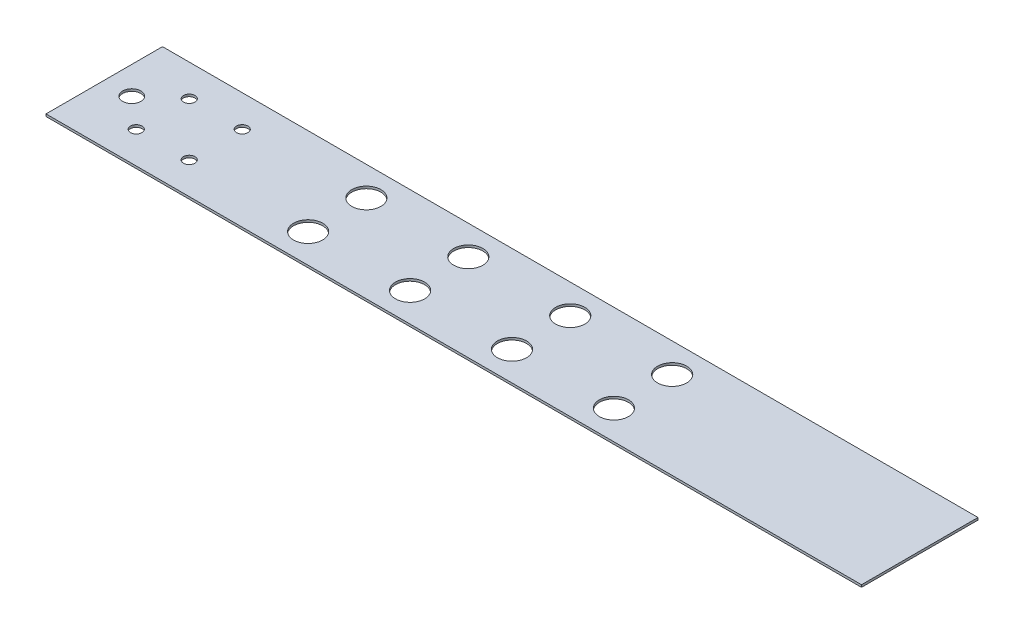
ISO-10303-21;
HEADER;
FILE_DESCRIPTION(('STEP AP214'),'2;1');
FILE_NAME('part.step','',(''),(''),'','','');
FILE_SCHEMA(('AUTOMOTIVE_DESIGN { 1 0 10303 214 1 1 1 1 }'));
ENDSEC;
DATA;
#1=APPLICATION_CONTEXT('core data for automotive mechanical design processes');
#2=APPLICATION_PROTOCOL_DEFINITION('international standard','automotive_design',2000,#1);
#3=PRODUCT_CONTEXT('',#1,'mechanical');
#4=PRODUCT('Part','Part','',(#3));
#5=PRODUCT_RELATED_PRODUCT_CATEGORY('part','',(#4));
#6=PRODUCT_DEFINITION_FORMATION('','',#4);
#7=PRODUCT_DEFINITION_CONTEXT('part definition',#1,'design');
#8=PRODUCT_DEFINITION('design','',#6,#7);
#9=PRODUCT_DEFINITION_SHAPE('','',#8);
#10=(LENGTH_UNIT() NAMED_UNIT(*) SI_UNIT(.MILLI.,.METRE.));
#11=(NAMED_UNIT(*) PLANE_ANGLE_UNIT() SI_UNIT($,.RADIAN.));
#12=(NAMED_UNIT(*) SI_UNIT($,.STERADIAN.) SOLID_ANGLE_UNIT());
#13=UNCERTAINTY_MEASURE_WITH_UNIT(LENGTH_MEASURE(1.E-05),#10,'distance_accuracy_value','');
#14=(GEOMETRIC_REPRESENTATION_CONTEXT(3) GLOBAL_UNCERTAINTY_ASSIGNED_CONTEXT((#13)) GLOBAL_UNIT_ASSIGNED_CONTEXT((#10,
#11,#12)) REPRESENTATION_CONTEXT('',''));
#15=CARTESIAN_POINT('',(0.,0.,0.));
#16=DIRECTION('',(0.,0.,1.));
#17=DIRECTION('',(1.,0.,0.));
#18=AXIS2_PLACEMENT_3D('',#15,#16,#17);
#19=CARTESIAN_POINT('',(-177.8,1.,25.4));
#20=DIRECTION('',(1.,0.,0.));
#21=DIRECTION('',(0.,0.,-1.));
#22=AXIS2_PLACEMENT_3D('',#19,#20,#21);
#23=PLANE('',#22);
#24=DIRECTION('',(0.,0.,1.));
#25=VECTOR('',#24,1.);
#26=CARTESIAN_POINT('',(-177.8,0.,25.4));
#27=LINE('',#26,#25);
#28=CARTESIAN_POINT('',(-177.8,0.,-25.4));
#29=VERTEX_POINT('',#28);
#30=CARTESIAN_POINT('',(-177.8,0.,25.4));
#31=VERTEX_POINT('',#30);
#32=EDGE_CURVE('E99',#29,#31,#27,.T.);
#33=ORIENTED_EDGE('',*,*,#32,.T.);
#34=DIRECTION('',(0.,-1.,0.));
#35=VECTOR('',#34,1.);
#36=CARTESIAN_POINT('',(-177.8,1.,25.4));
#37=LINE('',#36,#35);
#38=CARTESIAN_POINT('',(-177.8,1.,25.4));
#39=VERTEX_POINT('',#38);
#40=EDGE_CURVE('E11',#39,#31,#37,.T.);
#41=ORIENTED_EDGE('',*,*,#40,.F.);
#42=DIRECTION('',(0.,0.,1.));
#43=VECTOR('',#42,1.);
#44=CARTESIAN_POINT('',(-177.8,1.,25.4));
#45=LINE('',#44,#43);
#46=CARTESIAN_POINT('',(-177.8,1.,-25.4));
#47=VERTEX_POINT('',#46);
#48=EDGE_CURVE('E86',#47,#39,#45,.T.);
#49=ORIENTED_EDGE('',*,*,#48,.F.);
#50=DIRECTION('',(0.,-1.,0.));
#51=VECTOR('',#50,1.);
#52=CARTESIAN_POINT('',(-177.8,1.,-25.4));
#53=LINE('',#52,#51);
#54=EDGE_CURVE('E95',#47,#29,#53,.T.);
#55=ORIENTED_EDGE('',*,*,#54,.T.);
#56=EDGE_LOOP('',(#33,#41,#49,#55));
#57=FACE_BOUND('',#56,.T.);
#58=ADVANCED_FACE('F33',(#57),#23,.F.);
#59=CARTESIAN_POINT('',(177.8,1.,25.3999999999999));
#60=DIRECTION('',(0.,0.,-1.));
#61=DIRECTION('',(-1.,0.,0.));
#62=AXIS2_PLACEMENT_3D('',#59,#60,#61);
#63=PLANE('',#62);
#64=DIRECTION('',(1.,0.,0.));
#65=VECTOR('',#64,1.);
#66=CARTESIAN_POINT('',(177.8,0.,25.3999999999999));
#67=LINE('',#66,#65);
#68=CARTESIAN_POINT('',(177.8,0.,25.3999999999999));
#69=VERTEX_POINT('',#68);
#70=EDGE_CURVE('E90',#31,#69,#67,.T.);
#71=ORIENTED_EDGE('',*,*,#70,.T.);
#72=DIRECTION('',(0.,-1.,0.));
#73=VECTOR('',#72,1.);
#74=CARTESIAN_POINT('',(177.8,1.,25.3999999999999));
#75=LINE('',#74,#73);
#76=CARTESIAN_POINT('',(177.8,1.,25.3999999999999));
#77=VERTEX_POINT('',#76);
#78=EDGE_CURVE('E42',#77,#69,#75,.T.);
#79=ORIENTED_EDGE('',*,*,#78,.F.);
#80=DIRECTION('',(1.,0.,0.));
#81=VECTOR('',#80,1.);
#82=CARTESIAN_POINT('',(177.8,1.,25.3999999999999));
#83=LINE('',#82,#81);
#84=EDGE_CURVE('E81',#39,#77,#83,.T.);
#85=ORIENTED_EDGE('',*,*,#84,.F.);
#86=ORIENTED_EDGE('',*,*,#40,.T.);
#87=EDGE_LOOP('',(#71,#79,#85,#86));
#88=FACE_BOUND('',#87,.T.);
#89=ADVANCED_FACE('F89',(#88),#63,.F.);
#90=CARTESIAN_POINT('',(177.8,1.,25.3999999999999));
#91=DIRECTION('',(-1.,0.,0.));
#92=DIRECTION('',(0.,0.,1.));
#93=AXIS2_PLACEMENT_3D('',#90,#91,#92);
#94=PLANE('',#93);
#95=DIRECTION('',(0.,0.,-1.));
#96=VECTOR('',#95,1.);
#97=CARTESIAN_POINT('',(177.8,0.,25.3999999999999));
#98=LINE('',#97,#96);
#99=CARTESIAN_POINT('',(177.8,0.,-25.4));
#100=VERTEX_POINT('',#99);
#101=EDGE_CURVE('E68',#69,#100,#98,.T.);
#102=ORIENTED_EDGE('',*,*,#101,.T.);
#103=DIRECTION('',(0.,-1.,0.));
#104=VECTOR('',#103,1.);
#105=CARTESIAN_POINT('',(177.8,1.,-25.4));
#106=LINE('',#105,#104);
#107=CARTESIAN_POINT('',(177.8,1.,-25.4));
#108=VERTEX_POINT('',#107);
#109=EDGE_CURVE('E91',#108,#100,#106,.T.);
#110=ORIENTED_EDGE('',*,*,#109,.F.);
#111=DIRECTION('',(0.,0.,-1.));
#112=VECTOR('',#111,1.);
#113=CARTESIAN_POINT('',(177.8,1.,25.3999999999999));
#114=LINE('',#113,#112);
#115=EDGE_CURVE('E84',#77,#108,#114,.T.);
#116=ORIENTED_EDGE('',*,*,#115,.F.);
#117=ORIENTED_EDGE('',*,*,#78,.T.);
#118=EDGE_LOOP('',(#102,#110,#116,#117));
#119=FACE_BOUND('',#118,.T.);
#120=ADVANCED_FACE('F93',(#119),#94,.F.);
#121=CARTESIAN_POINT('',(177.8,1.,-25.4));
#122=DIRECTION('',(0.,0.,1.));
#123=DIRECTION('',(1.,0.,0.));
#124=AXIS2_PLACEMENT_3D('',#121,#122,#123);
#125=PLANE('',#124);
#126=DIRECTION('',(-1.,0.,0.));
#127=VECTOR('',#126,1.);
#128=CARTESIAN_POINT('',(177.8,0.,-25.4));
#129=LINE('',#128,#127);
#130=EDGE_CURVE('E74',#100,#29,#129,.T.);
#131=ORIENTED_EDGE('',*,*,#130,.T.);
#132=ORIENTED_EDGE('',*,*,#54,.F.);
#133=DIRECTION('',(-1.,0.,0.));
#134=VECTOR('',#133,1.);
#135=CARTESIAN_POINT('',(177.8,1.,-25.4));
#136=LINE('',#135,#134);
#137=EDGE_CURVE('E51',#108,#47,#136,.T.);
#138=ORIENTED_EDGE('',*,*,#137,.F.);
#139=ORIENTED_EDGE('',*,*,#109,.T.);
#140=EDGE_LOOP('',(#131,#132,#138,#139));
#141=FACE_BOUND('',#140,.T.);
#142=ADVANCED_FACE('F169',(#141),#125,.F.);
#143=CARTESIAN_POINT('',(0.,1.,0.));
#144=DIRECTION('',(0.,1.,0.));
#145=DIRECTION('',(0.,0.,1.));
#146=AXIS2_PLACEMENT_3D('',#143,#144,#145);
#147=PLANE('',#146);
#148=CARTESIAN_POINT('',(12.6999999999999,1.,-12.7));
#149=DIRECTION('',(0.,1.,0.));
#150=DIRECTION('',(0.,0.,1.));
#151=AXIS2_PLACEMENT_3D('',#148,#149,#150);
#152=CIRCLE('',#151,6.35);
#153=CARTESIAN_POINT('',(12.6999999999999,1.,-6.35000000000004));
#154=VERTEX_POINT('',#153);
#155=EDGE_CURVE('E339',#154,#154,#152,.T.);
#156=ORIENTED_EDGE('',*,*,#155,.F.);
#157=EDGE_LOOP('',(#156));
#158=FACE_BOUND('',#157,.T.);
#159=CARTESIAN_POINT('',(12.6999999999999,1.,12.7));
#160=DIRECTION('',(0.,1.,0.));
#161=DIRECTION('',(0.,0.,-1.));
#162=AXIS2_PLACEMENT_3D('',#159,#160,#161);
#163=CIRCLE('',#162,6.35);
#164=CARTESIAN_POINT('',(12.6999999999999,1.,6.35000000000004));
#165=VERTEX_POINT('',#164);
#166=EDGE_CURVE('E340',#165,#165,#163,.T.);
#167=ORIENTED_EDGE('',*,*,#166,.F.);
#168=EDGE_LOOP('',(#167));
#169=FACE_BOUND('',#168,.T.);
#170=CARTESIAN_POINT('',(-76.2,1.,12.7));
#171=DIRECTION('',(0.,1.,0.));
#172=DIRECTION('',(0.,0.,-1.));
#173=AXIS2_PLACEMENT_3D('',#170,#171,#172);
#174=CIRCLE('',#173,6.35);
#175=CARTESIAN_POINT('',(-76.2,1.,6.35000000000005));
#176=VERTEX_POINT('',#175);
#177=EDGE_CURVE('E345',#176,#176,#174,.T.);
#178=ORIENTED_EDGE('',*,*,#177,.F.);
#179=EDGE_LOOP('',(#178));
#180=FACE_BOUND('',#179,.T.);
#181=CARTESIAN_POINT('',(-31.7500000000001,1.,-12.7));
#182=DIRECTION('',(0.,1.,0.));
#183=DIRECTION('',(0.,0.,1.));
#184=AXIS2_PLACEMENT_3D('',#181,#182,#183);
#185=CIRCLE('',#184,6.35);
#186=CARTESIAN_POINT('',(-31.7500000000001,1.,-6.35000000000004));
#187=VERTEX_POINT('',#186);
#188=EDGE_CURVE('E353',#187,#187,#185,.T.);
#189=ORIENTED_EDGE('',*,*,#188,.F.);
#190=EDGE_LOOP('',(#189));
#191=FACE_BOUND('',#190,.T.);
#192=CARTESIAN_POINT('',(57.1499999999999,1.,-12.7));
#193=DIRECTION('',(0.,1.,0.));
#194=DIRECTION('',(0.,0.,1.));
#195=AXIS2_PLACEMENT_3D('',#192,#193,#194);
#196=CIRCLE('',#195,6.35);
#197=CARTESIAN_POINT('',(57.1499999999999,1.,-6.35000000000004));
#198=VERTEX_POINT('',#197);
#199=EDGE_CURVE('E355',#198,#198,#196,.T.);
#200=ORIENTED_EDGE('',*,*,#199,.F.);
#201=EDGE_LOOP('',(#200));
#202=FACE_BOUND('',#201,.T.);
#203=CARTESIAN_POINT('',(57.1499999999999,1.,12.7));
#204=DIRECTION('',(0.,1.,0.));
#205=DIRECTION('',(0.,0.,-1.));
#206=AXIS2_PLACEMENT_3D('',#203,#204,#205);
#207=CIRCLE('',#206,6.35);
#208=CARTESIAN_POINT('',(57.1499999999999,1.,6.35000000000004));
#209=VERTEX_POINT('',#208);
#210=EDGE_CURVE('E371',#209,#209,#207,.T.);
#211=ORIENTED_EDGE('',*,*,#210,.F.);
#212=EDGE_LOOP('',(#211));
#213=FACE_BOUND('',#212,.T.);
#214=CARTESIAN_POINT('',(-31.7500000000001,1.,12.7));
#215=DIRECTION('',(0.,1.,0.));
#216=DIRECTION('',(0.,0.,-1.));
#217=AXIS2_PLACEMENT_3D('',#214,#215,#216);
#218=CIRCLE('',#217,6.35);
#219=CARTESIAN_POINT('',(-31.7500000000001,1.,6.35000000000004));
#220=VERTEX_POINT('',#219);
#221=EDGE_CURVE('E348',#220,#220,#218,.T.);
#222=ORIENTED_EDGE('',*,*,#221,.F.);
#223=EDGE_LOOP('',(#222));
#224=FACE_BOUND('',#223,.T.);
#225=CARTESIAN_POINT('',(-76.2,1.,-12.7));
#226=DIRECTION('',(0.,1.,0.));
#227=DIRECTION('',(0.,0.,1.));
#228=AXIS2_PLACEMENT_3D('',#225,#226,#227);
#229=CIRCLE('',#228,6.35);
#230=CARTESIAN_POINT('',(-76.2,1.,-6.35000000000005));
#231=VERTEX_POINT('',#230);
#232=EDGE_CURVE('E126',#231,#231,#229,.T.);
#233=ORIENTED_EDGE('',*,*,#232,.F.);
#234=EDGE_LOOP('',(#233));
#235=FACE_BOUND('',#234,.T.);
#236=CARTESIAN_POINT('',(-152.3,1.,11.55));
#237=DIRECTION('',(0.,1.,0.));
#238=DIRECTION('',(0.,0.,1.));
#239=AXIS2_PLACEMENT_3D('',#236,#237,#238);
#240=CIRCLE('',#239,2.5);
#241=CARTESIAN_POINT('',(-152.3,1.,14.05));
#242=VERTEX_POINT('',#241);
#243=EDGE_CURVE('E145',#242,#242,#240,.T.);
#244=ORIENTED_EDGE('',*,*,#243,.F.);
#245=EDGE_LOOP('',(#244));
#246=FACE_BOUND('',#245,.T.);
#247=CARTESIAN_POINT('',(-129.2,1.,11.55));
#248=DIRECTION('',(0.,1.,0.));
#249=DIRECTION('',(0.,0.,1.));
#250=AXIS2_PLACEMENT_3D('',#247,#248,#249);
#251=CIRCLE('',#250,2.5);
#252=CARTESIAN_POINT('',(-129.2,1.,14.05));
#253=VERTEX_POINT('',#252);
#254=EDGE_CURVE('E149',#253,#253,#251,.T.);
#255=ORIENTED_EDGE('',*,*,#254,.F.);
#256=EDGE_LOOP('',(#255));
#257=FACE_BOUND('',#256,.T.);
#258=CARTESIAN_POINT('',(-129.2,1.,-11.55));
#259=DIRECTION('',(0.,1.,0.));
#260=DIRECTION('',(0.,0.,1.));
#261=AXIS2_PLACEMENT_3D('',#258,#259,#260);
#262=CIRCLE('',#261,2.5);
#263=CARTESIAN_POINT('',(-129.2,1.,-9.05000000000005));
#264=VERTEX_POINT('',#263);
#265=EDGE_CURVE('E154',#264,#264,#262,.T.);
#266=ORIENTED_EDGE('',*,*,#265,.F.);
#267=EDGE_LOOP('',(#266));
#268=FACE_BOUND('',#267,.T.);
#269=CARTESIAN_POINT('',(-152.3,1.,-11.55));
#270=DIRECTION('',(0.,1.,0.));
#271=DIRECTION('',(0.,0.,1.));
#272=AXIS2_PLACEMENT_3D('',#269,#270,#271);
#273=CIRCLE('',#272,2.5);
#274=CARTESIAN_POINT('',(-152.3,1.,-9.05000000000005));
#275=VERTEX_POINT('',#274);
#276=EDGE_CURVE('E112',#275,#275,#273,.T.);
#277=ORIENTED_EDGE('',*,*,#276,.F.);
#278=EDGE_LOOP('',(#277));
#279=FACE_BOUND('',#278,.T.);
#280=CARTESIAN_POINT('',(-165.8,1.,0.));
#281=DIRECTION('',(0.,1.,0.));
#282=DIRECTION('',(0.,0.,1.));
#283=AXIS2_PLACEMENT_3D('',#280,#281,#282);
#284=CIRCLE('',#283,3.96874999999999);
#285=CARTESIAN_POINT('',(-165.8,1.,3.96874999999999));
#286=VERTEX_POINT('',#285);
#287=EDGE_CURVE('E121',#286,#286,#284,.T.);
#288=ORIENTED_EDGE('',*,*,#287,.F.);
#289=EDGE_LOOP('',(#288));
#290=FACE_BOUND('',#289,.T.);
#291=ORIENTED_EDGE('',*,*,#48,.T.);
#292=ORIENTED_EDGE('',*,*,#84,.T.);
#293=ORIENTED_EDGE('',*,*,#115,.T.);
#294=ORIENTED_EDGE('',*,*,#137,.T.);
#295=EDGE_LOOP('',(#291,#292,#293,#294));
#296=FACE_BOUND('',#295,.T.);
#297=ADVANCED_FACE('F82',(#158,#169,#180,#191,#202,#213,#224,#235,#246,#257,#268,#279,#290,
#296),#147,.T.);
#298=CARTESIAN_POINT('',(0.,0.,0.));
#299=DIRECTION('',(0.,1.,0.));
#300=DIRECTION('',(0.,0.,1.));
#301=AXIS2_PLACEMENT_3D('',#298,#299,#300);
#302=PLANE('',#301);
#303=CARTESIAN_POINT('',(12.6999999999999,0.,-12.7));
#304=DIRECTION('',(0.,1.,0.));
#305=DIRECTION('',(0.,0.,1.));
#306=AXIS2_PLACEMENT_3D('',#303,#304,#305);
#307=CIRCLE('',#306,6.35);
#308=CARTESIAN_POINT('',(12.6999999999999,0.,-6.35000000000004));
#309=VERTEX_POINT('',#308);
#310=EDGE_CURVE('E36',#309,#309,#307,.T.);
#311=ORIENTED_EDGE('',*,*,#310,.T.);
#312=EDGE_LOOP('',(#311));
#313=FACE_BOUND('',#312,.T.);
#314=CARTESIAN_POINT('',(12.6999999999999,0.,12.7));
#315=DIRECTION('',(0.,1.,0.));
#316=DIRECTION('',(0.,0.,1.));
#317=AXIS2_PLACEMENT_3D('',#314,#315,#316);
#318=CIRCLE('',#317,6.35);
#319=CARTESIAN_POINT('',(12.6999999999999,0.,19.05));
#320=VERTEX_POINT('',#319);
#321=EDGE_CURVE('E140',#320,#320,#318,.T.);
#322=ORIENTED_EDGE('',*,*,#321,.T.);
#323=EDGE_LOOP('',(#322));
#324=FACE_BOUND('',#323,.T.);
#325=CARTESIAN_POINT('',(-76.2,0.,12.7));
#326=DIRECTION('',(0.,1.,0.));
#327=DIRECTION('',(0.,0.,1.));
#328=AXIS2_PLACEMENT_3D('',#325,#326,#327);
#329=CIRCLE('',#328,6.35);
#330=CARTESIAN_POINT('',(-76.2,0.,19.05));
#331=VERTEX_POINT('',#330);
#332=EDGE_CURVE('E138',#331,#331,#329,.T.);
#333=ORIENTED_EDGE('',*,*,#332,.T.);
#334=EDGE_LOOP('',(#333));
#335=FACE_BOUND('',#334,.T.);
#336=CARTESIAN_POINT('',(-31.7500000000001,0.,-12.7));
#337=DIRECTION('',(0.,1.,0.));
#338=DIRECTION('',(0.,0.,1.));
#339=AXIS2_PLACEMENT_3D('',#336,#337,#338);
#340=CIRCLE('',#339,6.35);
#341=CARTESIAN_POINT('',(-31.7500000000001,0.,-6.35000000000004));
#342=VERTEX_POINT('',#341);
#343=EDGE_CURVE('E135',#342,#342,#340,.T.);
#344=ORIENTED_EDGE('',*,*,#343,.T.);
#345=EDGE_LOOP('',(#344));
#346=FACE_BOUND('',#345,.T.);
#347=CARTESIAN_POINT('',(57.1499999999999,0.,-12.7));
#348=DIRECTION('',(0.,1.,0.));
#349=DIRECTION('',(0.,0.,1.));
#350=AXIS2_PLACEMENT_3D('',#347,#348,#349);
#351=CIRCLE('',#350,6.35);
#352=CARTESIAN_POINT('',(57.1499999999999,0.,-6.35000000000004));
#353=VERTEX_POINT('',#352);
#354=EDGE_CURVE('E132',#353,#353,#351,.T.);
#355=ORIENTED_EDGE('',*,*,#354,.T.);
#356=EDGE_LOOP('',(#355));
#357=FACE_BOUND('',#356,.T.);
#358=CARTESIAN_POINT('',(57.1499999999999,0.,12.7));
#359=DIRECTION('',(0.,1.,0.));
#360=DIRECTION('',(0.,0.,1.));
#361=AXIS2_PLACEMENT_3D('',#358,#359,#360);
#362=CIRCLE('',#361,6.35);
#363=CARTESIAN_POINT('',(57.1499999999999,0.,19.05));
#364=VERTEX_POINT('',#363);
#365=EDGE_CURVE('E129',#364,#364,#362,.T.);
#366=ORIENTED_EDGE('',*,*,#365,.T.);
#367=EDGE_LOOP('',(#366));
#368=FACE_BOUND('',#367,.T.);
#369=CARTESIAN_POINT('',(-31.7500000000001,0.,12.7));
#370=DIRECTION('',(0.,1.,0.));
#371=DIRECTION('',(0.,0.,1.));
#372=AXIS2_PLACEMENT_3D('',#369,#370,#371);
#373=CIRCLE('',#372,6.35);
#374=CARTESIAN_POINT('',(-31.7500000000001,0.,19.05));
#375=VERTEX_POINT('',#374);
#376=EDGE_CURVE('E125',#375,#375,#373,.T.);
#377=ORIENTED_EDGE('',*,*,#376,.T.);
#378=EDGE_LOOP('',(#377));
#379=FACE_BOUND('',#378,.T.);
#380=CARTESIAN_POINT('',(-76.2,0.,-12.7));
#381=DIRECTION('',(0.,1.,0.));
#382=DIRECTION('',(0.,0.,1.));
#383=AXIS2_PLACEMENT_3D('',#380,#381,#382);
#384=CIRCLE('',#383,6.35);
#385=CARTESIAN_POINT('',(-76.2,0.,-6.35000000000005));
#386=VERTEX_POINT('',#385);
#387=EDGE_CURVE('E122',#386,#386,#384,.T.);
#388=ORIENTED_EDGE('',*,*,#387,.T.);
#389=EDGE_LOOP('',(#388));
#390=FACE_BOUND('',#389,.T.);
#391=CARTESIAN_POINT('',(-152.3,0.,11.55));
#392=DIRECTION('',(0.,1.,0.));
#393=DIRECTION('',(0.,0.,1.));
#394=AXIS2_PLACEMENT_3D('',#391,#392,#393);
#395=CIRCLE('',#394,2.5);
#396=CARTESIAN_POINT('',(-152.3,0.,14.05));
#397=VERTEX_POINT('',#396);
#398=EDGE_CURVE('E118',#397,#397,#395,.T.);
#399=ORIENTED_EDGE('',*,*,#398,.T.);
#400=EDGE_LOOP('',(#399));
#401=FACE_BOUND('',#400,.T.);
#402=CARTESIAN_POINT('',(-129.2,0.,11.55));
#403=DIRECTION('',(0.,1.,0.));
#404=DIRECTION('',(0.,0.,1.));
#405=AXIS2_PLACEMENT_3D('',#402,#403,#404);
#406=CIRCLE('',#405,2.5);
#407=CARTESIAN_POINT('',(-129.2,0.,14.05));
#408=VERTEX_POINT('',#407);
#409=EDGE_CURVE('E115',#408,#408,#406,.T.);
#410=ORIENTED_EDGE('',*,*,#409,.T.);
#411=EDGE_LOOP('',(#410));
#412=FACE_BOUND('',#411,.T.);
#413=CARTESIAN_POINT('',(-129.2,0.,-11.55));
#414=DIRECTION('',(0.,1.,0.));
#415=DIRECTION('',(0.,0.,1.));
#416=AXIS2_PLACEMENT_3D('',#413,#414,#415);
#417=CIRCLE('',#416,2.5);
#418=CARTESIAN_POINT('',(-129.2,0.,-9.05000000000005));
#419=VERTEX_POINT('',#418);
#420=EDGE_CURVE('E111',#419,#419,#417,.T.);
#421=ORIENTED_EDGE('',*,*,#420,.T.);
#422=EDGE_LOOP('',(#421));
#423=FACE_BOUND('',#422,.T.);
#424=CARTESIAN_POINT('',(-152.3,0.,-11.55));
#425=DIRECTION('',(0.,1.,0.));
#426=DIRECTION('',(0.,0.,1.));
#427=AXIS2_PLACEMENT_3D('',#424,#425,#426);
#428=CIRCLE('',#427,2.5);
#429=CARTESIAN_POINT('',(-152.3,0.,-9.05000000000005));
#430=VERTEX_POINT('',#429);
#431=EDGE_CURVE('E108',#430,#430,#428,.T.);
#432=ORIENTED_EDGE('',*,*,#431,.T.);
#433=EDGE_LOOP('',(#432));
#434=FACE_BOUND('',#433,.T.);
#435=CARTESIAN_POINT('',(-165.8,0.,0.));
#436=DIRECTION('',(0.,1.,0.));
#437=DIRECTION('',(0.,0.,1.));
#438=AXIS2_PLACEMENT_3D('',#435,#436,#437);
#439=CIRCLE('',#438,3.96874999999999);
#440=CARTESIAN_POINT('',(-165.8,0.,3.96874999999999));
#441=VERTEX_POINT('',#440);
#442=EDGE_CURVE('E102',#441,#441,#439,.T.);
#443=ORIENTED_EDGE('',*,*,#442,.T.);
#444=EDGE_LOOP('',(#443));
#445=FACE_BOUND('',#444,.T.);
#446=ORIENTED_EDGE('',*,*,#32,.F.);
#447=ORIENTED_EDGE('',*,*,#130,.F.);
#448=ORIENTED_EDGE('',*,*,#101,.F.);
#449=ORIENTED_EDGE('',*,*,#70,.F.);
#450=EDGE_LOOP('',(#446,#447,#448,#449));
#451=FACE_BOUND('',#450,.T.);
#452=ADVANCED_FACE('F168',(#313,#324,#335,#346,#357,#368,#379,#390,#401,#412,#423,#434,#445,
#451),#302,.F.);
#453=CARTESIAN_POINT('',(-165.8,0.,0.));
#454=DIRECTION('',(0.,1.,0.));
#455=DIRECTION('',(0.,0.,1.));
#456=AXIS2_PLACEMENT_3D('',#453,#454,#455);
#457=CYLINDRICAL_SURFACE('',#456,3.96874999999999);
#458=ORIENTED_EDGE('',*,*,#442,.F.);
#459=EDGE_LOOP('',(#458));
#460=FACE_BOUND('',#459,.T.);
#461=ORIENTED_EDGE('',*,*,#287,.T.);
#462=EDGE_LOOP('',(#461));
#463=FACE_BOUND('',#462,.T.);
#464=ADVANCED_FACE('F165',(#460,#463),#457,.F.);
#465=CARTESIAN_POINT('',(-152.3,-1.,-11.55));
#466=DIRECTION('',(0.,1.,0.));
#467=DIRECTION('',(0.,0.,1.));
#468=AXIS2_PLACEMENT_3D('',#465,#466,#467);
#469=CYLINDRICAL_SURFACE('',#468,2.5);
#470=ORIENTED_EDGE('',*,*,#276,.T.);
#471=EDGE_LOOP('',(#470));
#472=FACE_BOUND('',#471,.T.);
#473=ORIENTED_EDGE('',*,*,#431,.F.);
#474=EDGE_LOOP('',(#473));
#475=FACE_BOUND('',#474,.T.);
#476=ADVANCED_FACE('F217',(#472,#475),#469,.F.);
#477=CARTESIAN_POINT('',(-129.2,-1.,-11.55));
#478=DIRECTION('',(0.,1.,0.));
#479=DIRECTION('',(0.,0.,1.));
#480=AXIS2_PLACEMENT_3D('',#477,#478,#479);
#481=CYLINDRICAL_SURFACE('',#480,2.5);
#482=ORIENTED_EDGE('',*,*,#265,.T.);
#483=EDGE_LOOP('',(#482));
#484=FACE_BOUND('',#483,.T.);
#485=ORIENTED_EDGE('',*,*,#420,.F.);
#486=EDGE_LOOP('',(#485));
#487=FACE_BOUND('',#486,.T.);
#488=ADVANCED_FACE('F223',(#484,#487),#481,.F.);
#489=CARTESIAN_POINT('',(-129.2,-1.,11.55));
#490=DIRECTION('',(0.,1.,0.));
#491=DIRECTION('',(0.,0.,1.));
#492=AXIS2_PLACEMENT_3D('',#489,#490,#491);
#493=CYLINDRICAL_SURFACE('',#492,2.5);
#494=ORIENTED_EDGE('',*,*,#254,.T.);
#495=EDGE_LOOP('',(#494));
#496=FACE_BOUND('',#495,.T.);
#497=ORIENTED_EDGE('',*,*,#409,.F.);
#498=EDGE_LOOP('',(#497));
#499=FACE_BOUND('',#498,.T.);
#500=ADVANCED_FACE('F231',(#496,#499),#493,.F.);
#501=CARTESIAN_POINT('',(-152.3,-1.,11.55));
#502=DIRECTION('',(0.,1.,0.));
#503=DIRECTION('',(0.,0.,1.));
#504=AXIS2_PLACEMENT_3D('',#501,#502,#503);
#505=CYLINDRICAL_SURFACE('',#504,2.5);
#506=ORIENTED_EDGE('',*,*,#243,.T.);
#507=EDGE_LOOP('',(#506));
#508=FACE_BOUND('',#507,.T.);
#509=ORIENTED_EDGE('',*,*,#398,.F.);
#510=EDGE_LOOP('',(#509));
#511=FACE_BOUND('',#510,.T.);
#512=ADVANCED_FACE('F239',(#508,#511),#505,.F.);
#513=CARTESIAN_POINT('',(-76.2,-1.,-12.7));
#514=DIRECTION('',(0.,1.,0.));
#515=DIRECTION('',(0.,0.,1.));
#516=AXIS2_PLACEMENT_3D('',#513,#514,#515);
#517=CYLINDRICAL_SURFACE('',#516,6.35);
#518=ORIENTED_EDGE('',*,*,#232,.T.);
#519=EDGE_LOOP('',(#518));
#520=FACE_BOUND('',#519,.T.);
#521=ORIENTED_EDGE('',*,*,#387,.F.);
#522=EDGE_LOOP('',(#521));
#523=FACE_BOUND('',#522,.T.);
#524=ADVANCED_FACE('F246',(#520,#523),#517,.F.);
#525=CARTESIAN_POINT('',(-31.7500000000001,-1.,12.7));
#526=DIRECTION('',(0.,1.,0.));
#527=DIRECTION('',(0.,0.,1.));
#528=AXIS2_PLACEMENT_3D('',#525,#526,#527);
#529=CYLINDRICAL_SURFACE('',#528,6.35);
#530=ORIENTED_EDGE('',*,*,#221,.T.);
#531=EDGE_LOOP('',(#530));
#532=FACE_BOUND('',#531,.T.);
#533=ORIENTED_EDGE('',*,*,#376,.F.);
#534=EDGE_LOOP('',(#533));
#535=FACE_BOUND('',#534,.T.);
#536=ADVANCED_FACE('F252',(#532,#535),#529,.F.);
#537=CARTESIAN_POINT('',(57.1499999999999,-1.,12.7));
#538=DIRECTION('',(0.,1.,0.));
#539=DIRECTION('',(0.,0.,1.));
#540=AXIS2_PLACEMENT_3D('',#537,#538,#539);
#541=CYLINDRICAL_SURFACE('',#540,6.35);
#542=ORIENTED_EDGE('',*,*,#210,.T.);
#543=EDGE_LOOP('',(#542));
#544=FACE_BOUND('',#543,.T.);
#545=ORIENTED_EDGE('',*,*,#365,.F.);
#546=EDGE_LOOP('',(#545));
#547=FACE_BOUND('',#546,.T.);
#548=ADVANCED_FACE('F260',(#544,#547),#541,.F.);
#549=CARTESIAN_POINT('',(57.1499999999999,-1.,-12.7));
#550=DIRECTION('',(0.,1.,0.));
#551=DIRECTION('',(0.,0.,1.));
#552=AXIS2_PLACEMENT_3D('',#549,#550,#551);
#553=CYLINDRICAL_SURFACE('',#552,6.35);
#554=ORIENTED_EDGE('',*,*,#199,.T.);
#555=EDGE_LOOP('',(#554));
#556=FACE_BOUND('',#555,.T.);
#557=ORIENTED_EDGE('',*,*,#354,.F.);
#558=EDGE_LOOP('',(#557));
#559=FACE_BOUND('',#558,.T.);
#560=ADVANCED_FACE('F268',(#556,#559),#553,.F.);
#561=CARTESIAN_POINT('',(-31.7500000000001,-1.,-12.7));
#562=DIRECTION('',(0.,1.,0.));
#563=DIRECTION('',(0.,0.,1.));
#564=AXIS2_PLACEMENT_3D('',#561,#562,#563);
#565=CYLINDRICAL_SURFACE('',#564,6.35);
#566=ORIENTED_EDGE('',*,*,#188,.T.);
#567=EDGE_LOOP('',(#566));
#568=FACE_BOUND('',#567,.T.);
#569=ORIENTED_EDGE('',*,*,#343,.F.);
#570=EDGE_LOOP('',(#569));
#571=FACE_BOUND('',#570,.T.);
#572=ADVANCED_FACE('F276',(#568,#571),#565,.F.);
#573=CARTESIAN_POINT('',(-76.2,-1.,12.7));
#574=DIRECTION('',(0.,1.,0.));
#575=DIRECTION('',(0.,0.,1.));
#576=AXIS2_PLACEMENT_3D('',#573,#574,#575);
#577=CYLINDRICAL_SURFACE('',#576,6.35);
#578=ORIENTED_EDGE('',*,*,#177,.T.);
#579=EDGE_LOOP('',(#578));
#580=FACE_BOUND('',#579,.T.);
#581=ORIENTED_EDGE('',*,*,#332,.F.);
#582=EDGE_LOOP('',(#581));
#583=FACE_BOUND('',#582,.T.);
#584=ADVANCED_FACE('F284',(#580,#583),#577,.F.);
#585=CARTESIAN_POINT('',(12.6999999999999,-1.,12.7));
#586=DIRECTION('',(0.,1.,0.));
#587=DIRECTION('',(0.,0.,1.));
#588=AXIS2_PLACEMENT_3D('',#585,#586,#587);
#589=CYLINDRICAL_SURFACE('',#588,6.35);
#590=ORIENTED_EDGE('',*,*,#166,.T.);
#591=EDGE_LOOP('',(#590));
#592=FACE_BOUND('',#591,.T.);
#593=ORIENTED_EDGE('',*,*,#321,.F.);
#594=EDGE_LOOP('',(#593));
#595=FACE_BOUND('',#594,.T.);
#596=ADVANCED_FACE('F292',(#592,#595),#589,.F.);
#597=CARTESIAN_POINT('',(12.6999999999999,-1.,-12.7));
#598=DIRECTION('',(0.,1.,0.));
#599=DIRECTION('',(0.,0.,1.));
#600=AXIS2_PLACEMENT_3D('',#597,#598,#599);
#601=CYLINDRICAL_SURFACE('',#600,6.35);
#602=ORIENTED_EDGE('',*,*,#155,.T.);
#603=EDGE_LOOP('',(#602));
#604=FACE_BOUND('',#603,.T.);
#605=ORIENTED_EDGE('',*,*,#310,.F.);
#606=EDGE_LOOP('',(#605));
#607=FACE_BOUND('',#606,.T.);
#608=ADVANCED_FACE('F300',(#604,#607),#601,.F.);
#609=CLOSED_SHELL('',(#58,#89,#120,#142,#297,#452,#464,#476,#488,#500,#512,#524,#536,#548,#560,
#572,#584,#596,#608));
#610=MANIFOLD_SOLID_BREP('B2',#609);
#611=ADVANCED_BREP_SHAPE_REPRESENTATION('',(#18,#610),#14);
#612=SHAPE_DEFINITION_REPRESENTATION(#9,#611);
ENDSEC;
END-ISO-10303-21;
